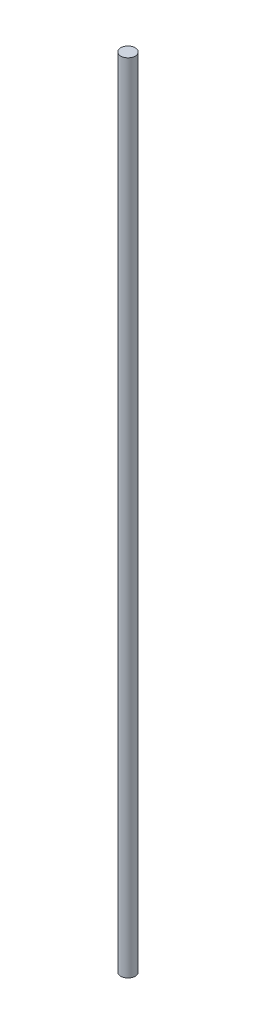
ISO-10303-21;
HEADER;
FILE_DESCRIPTION(('STEP AP214'),'2;1');
FILE_NAME('part.step','',(''),(''),'','','');
FILE_SCHEMA(('AUTOMOTIVE_DESIGN { 1 0 10303 214 1 1 1 1 }'));
ENDSEC;
DATA;
#1=APPLICATION_CONTEXT('core data for automotive mechanical design processes');
#2=APPLICATION_PROTOCOL_DEFINITION('international standard','automotive_design',2000,#1);
#3=PRODUCT_CONTEXT('',#1,'mechanical');
#4=PRODUCT('Part','Part','',(#3));
#5=PRODUCT_RELATED_PRODUCT_CATEGORY('part','',(#4));
#6=PRODUCT_DEFINITION_FORMATION('','',#4);
#7=PRODUCT_DEFINITION_CONTEXT('part definition',#1,'design');
#8=PRODUCT_DEFINITION('design','',#6,#7);
#9=PRODUCT_DEFINITION_SHAPE('','',#8);
#10=(LENGTH_UNIT() NAMED_UNIT(*) SI_UNIT(.MILLI.,.METRE.));
#11=(NAMED_UNIT(*) PLANE_ANGLE_UNIT() SI_UNIT($,.RADIAN.));
#12=(NAMED_UNIT(*) SI_UNIT($,.STERADIAN.) SOLID_ANGLE_UNIT());
#13=UNCERTAINTY_MEASURE_WITH_UNIT(LENGTH_MEASURE(1.E-05),#10,'distance_accuracy_value','');
#14=(GEOMETRIC_REPRESENTATION_CONTEXT(3) GLOBAL_UNCERTAINTY_ASSIGNED_CONTEXT((#13)) GLOBAL_UNIT_ASSIGNED_CONTEXT((#10,
#11,#12)) REPRESENTATION_CONTEXT('',''));
#15=CARTESIAN_POINT('',(0.,0.,0.));
#16=DIRECTION('',(0.,0.,1.));
#17=DIRECTION('',(1.,0.,0.));
#18=AXIS2_PLACEMENT_3D('',#15,#16,#17);
#19=CARTESIAN_POINT('',(-18.8415916624649,220.,0.));
#20=DIRECTION('',(0.,-1.,0.));
#21=DIRECTION('',(0.,0.,-1.));
#22=AXIS2_PLACEMENT_3D('',#19,#20,#21);
#23=CYLINDRICAL_SURFACE('',#22,2.);
#24=CARTESIAN_POINT('',(-18.8415916624649,220.,0.));
#25=DIRECTION('',(0.,1.,0.));
#26=DIRECTION('',(0.,0.,1.));
#27=AXIS2_PLACEMENT_3D('',#24,#25,#26);
#28=CIRCLE('',#27,2.);
#29=CARTESIAN_POINT('',(-18.8415916624649,220.,2.));
#30=VERTEX_POINT('',#29);
#31=EDGE_CURVE('E10',#30,#30,#28,.T.);
#32=ORIENTED_EDGE('',*,*,#31,.F.);
#33=EDGE_LOOP('',(#32));
#34=FACE_BOUND('',#33,.T.);
#35=CARTESIAN_POINT('',(-18.8415916624649,0.,0.));
#36=DIRECTION('',(0.,1.,0.));
#37=DIRECTION('',(0.,0.,1.));
#38=AXIS2_PLACEMENT_3D('',#35,#36,#37);
#39=CIRCLE('',#38,2.);
#40=CARTESIAN_POINT('',(-18.8415916624649,0.,2.));
#41=VERTEX_POINT('',#40);
#42=EDGE_CURVE('E33',#41,#41,#39,.T.);
#43=ORIENTED_EDGE('',*,*,#42,.T.);
#44=EDGE_LOOP('',(#43));
#45=FACE_BOUND('',#44,.T.);
#46=ADVANCED_FACE('F30',(#34,#45),#23,.T.);
#47=CARTESIAN_POINT('',(-18.8415916624649,220.,0.));
#48=DIRECTION('',(0.,1.,0.));
#49=DIRECTION('',(0.,0.,1.));
#50=AXIS2_PLACEMENT_3D('',#47,#48,#49);
#51=PLANE('',#50);
#52=ORIENTED_EDGE('',*,*,#31,.T.);
#53=EDGE_LOOP('',(#52));
#54=FACE_BOUND('',#53,.T.);
#55=ADVANCED_FACE('F45',(#54),#51,.T.);
#56=CARTESIAN_POINT('',(-18.8415916624649,0.,0.));
#57=DIRECTION('',(0.,1.,0.));
#58=DIRECTION('',(0.,0.,1.));
#59=AXIS2_PLACEMENT_3D('',#56,#57,#58);
#60=PLANE('',#59);
#61=ORIENTED_EDGE('',*,*,#42,.F.);
#62=EDGE_LOOP('',(#61));
#63=FACE_BOUND('',#62,.T.);
#64=ADVANCED_FACE('F43',(#63),#60,.F.);
#65=CLOSED_SHELL('',(#46,#55,#64));
#66=MANIFOLD_SOLID_BREP('B2',#65);
#67=ADVANCED_BREP_SHAPE_REPRESENTATION('',(#18,#66),#14);
#68=SHAPE_DEFINITION_REPRESENTATION(#9,#67);
ENDSEC;
END-ISO-10303-21;
